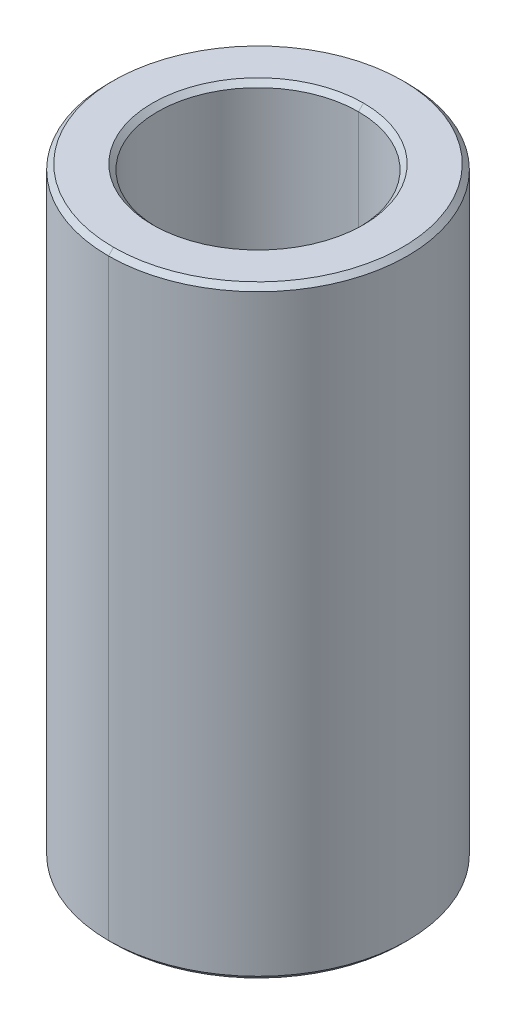
ISO-10303-21;
HEADER;
FILE_DESCRIPTION(('STEP AP214'),'2;1');
FILE_NAME('part.step','',(''),(''),'','','');
FILE_SCHEMA(('AUTOMOTIVE_DESIGN { 1 0 10303 214 1 1 1 1 }'));
ENDSEC;
DATA;
#1=APPLICATION_CONTEXT('core data for automotive mechanical design processes');
#2=APPLICATION_PROTOCOL_DEFINITION('international standard','automotive_design',2000,#1);
#3=PRODUCT_CONTEXT('',#1,'mechanical');
#4=PRODUCT('Part','Part','',(#3));
#5=PRODUCT_RELATED_PRODUCT_CATEGORY('part','',(#4));
#6=PRODUCT_DEFINITION_FORMATION('','',#4);
#7=PRODUCT_DEFINITION_CONTEXT('part definition',#1,'design');
#8=PRODUCT_DEFINITION('design','',#6,#7);
#9=PRODUCT_DEFINITION_SHAPE('','',#8);
#10=(LENGTH_UNIT() NAMED_UNIT(*) SI_UNIT(.MILLI.,.METRE.));
#11=(NAMED_UNIT(*) PLANE_ANGLE_UNIT() SI_UNIT($,.RADIAN.));
#12=(NAMED_UNIT(*) SI_UNIT($,.STERADIAN.) SOLID_ANGLE_UNIT());
#13=UNCERTAINTY_MEASURE_WITH_UNIT(LENGTH_MEASURE(1.E-05),#10,'distance_accuracy_value','');
#14=(GEOMETRIC_REPRESENTATION_CONTEXT(3) GLOBAL_UNCERTAINTY_ASSIGNED_CONTEXT((#13)) GLOBAL_UNIT_ASSIGNED_CONTEXT((#10,
#11,#12)) REPRESENTATION_CONTEXT('',''));
#15=CARTESIAN_POINT('',(0.,0.,0.));
#16=DIRECTION('',(0.,0.,1.));
#17=DIRECTION('',(1.,0.,0.));
#18=AXIS2_PLACEMENT_3D('',#15,#16,#17);
#19=CARTESIAN_POINT('',(0.,5.9,0.));
#20=DIRECTION('',(0.,1.,0.));
#21=DIRECTION('',(0.,0.,1.));
#22=AXIS2_PLACEMENT_3D('',#19,#20,#21);
#23=CONICAL_SURFACE('',#22,2.,0.785398163397457);
#24=DIRECTION('',(0.,0.707106781186542,-0.707106781186554));
#25=VECTOR('',#24,1.);
#26=CARTESIAN_POINT('',(0.,5.9,-2.));
#27=LINE('',#26,#25);
#28=CARTESIAN_POINT('',(0.,5.9,-2.));
#29=VERTEX_POINT('',#28);
#30=CARTESIAN_POINT('',(0.,6.,-2.1));
#31=VERTEX_POINT('',#30);
#32=EDGE_CURVE('E192',#29,#31,#27,.T.);
#33=ORIENTED_EDGE('',*,*,#32,.F.);
#34=CARTESIAN_POINT('',(0.,5.9,0.));
#35=DIRECTION('',(0.,1.,0.));
#36=DIRECTION('',(0.,0.,1.));
#37=AXIS2_PLACEMENT_3D('',#34,#35,#36);
#38=CIRCLE('',#37,2.);
#39=CARTESIAN_POINT('',(0.,5.9,2.));
#40=VERTEX_POINT('',#39);
#41=EDGE_CURVE('E24',#40,#29,#38,.T.);
#42=ORIENTED_EDGE('',*,*,#41,.F.);
#43=DIRECTION('',(0.,0.707106781186542,0.707106781186554));
#44=VECTOR('',#43,1.);
#45=CARTESIAN_POINT('',(0.,5.9,2.));
#46=LINE('',#45,#44);
#47=CARTESIAN_POINT('',(0.,6.,2.1));
#48=VERTEX_POINT('',#47);
#49=EDGE_CURVE('E136',#40,#48,#46,.T.);
#50=ORIENTED_EDGE('',*,*,#49,.T.);
#51=CARTESIAN_POINT('',(0.,6.,0.));
#52=DIRECTION('',(0.,-1.,0.));
#53=DIRECTION('',(0.,0.,1.));
#54=AXIS2_PLACEMENT_3D('',#51,#52,#53);
#55=CIRCLE('',#54,2.1);
#56=EDGE_CURVE('E166',#31,#48,#55,.T.);
#57=ORIENTED_EDGE('',*,*,#56,.F.);
#58=EDGE_LOOP('',(#33,#42,#50,#57));
#59=FACE_BOUND('',#58,.T.);
#60=ADVANCED_FACE('F15',(#59),#23,.F.);
#61=CARTESIAN_POINT('',(0.,-6.,0.));
#62=DIRECTION('',(0.,-1.,0.));
#63=DIRECTION('',(0.,0.,-1.));
#64=AXIS2_PLACEMENT_3D('',#61,#62,#63);
#65=CONICAL_SURFACE('',#64,2.1,0.785398163397448);
#66=DIRECTION('',(0.,-0.707106781186548,0.707106781186548));
#67=VECTOR('',#66,1.);
#68=CARTESIAN_POINT('',(0.,-6.,2.1));
#69=LINE('',#68,#67);
#70=CARTESIAN_POINT('',(0.,-5.9,2.));
#71=VERTEX_POINT('',#70);
#72=CARTESIAN_POINT('',(0.,-6.,2.1));
#73=VERTEX_POINT('',#72);
#74=EDGE_CURVE('E110',#71,#73,#69,.T.);
#75=ORIENTED_EDGE('',*,*,#74,.F.);
#76=CARTESIAN_POINT('',(0.,-5.9,0.));
#77=DIRECTION('',(0.,-1.,0.));
#78=DIRECTION('',(0.,0.,1.));
#79=AXIS2_PLACEMENT_3D('',#76,#77,#78);
#80=CIRCLE('',#79,2.);
#81=CARTESIAN_POINT('',(0.,-5.9,-2.));
#82=VERTEX_POINT('',#81);
#83=EDGE_CURVE('E10',#82,#71,#80,.T.);
#84=ORIENTED_EDGE('',*,*,#83,.F.);
#85=DIRECTION('',(0.,-0.707106781186548,-0.707106781186548));
#86=VECTOR('',#85,1.);
#87=CARTESIAN_POINT('',(0.,-6.,-2.1));
#88=LINE('',#87,#86);
#89=CARTESIAN_POINT('',(0.,-6.,-2.1));
#90=VERTEX_POINT('',#89);
#91=EDGE_CURVE('E107',#82,#90,#88,.T.);
#92=ORIENTED_EDGE('',*,*,#91,.T.);
#93=CARTESIAN_POINT('',(0.,-6.,0.));
#94=DIRECTION('',(0.,1.,0.));
#95=DIRECTION('',(0.,0.,1.));
#96=AXIS2_PLACEMENT_3D('',#93,#94,#95);
#97=CIRCLE('',#96,2.1);
#98=EDGE_CURVE('E165',#73,#90,#97,.T.);
#99=ORIENTED_EDGE('',*,*,#98,.F.);
#100=EDGE_LOOP('',(#75,#84,#92,#99));
#101=FACE_BOUND('',#100,.T.);
#102=ADVANCED_FACE('F105',(#101),#65,.F.);
#103=CARTESIAN_POINT('',(0.,6.,0.));
#104=DIRECTION('',(0.,-1.,0.));
#105=DIRECTION('',(0.,0.,-1.));
#106=AXIS2_PLACEMENT_3D('',#103,#104,#105);
#107=CONICAL_SURFACE('',#106,2.875,0.785398163397443);
#108=DIRECTION('',(0.,-0.707106781186551,0.707106781186545));
#109=VECTOR('',#108,1.);
#110=CARTESIAN_POINT('',(0.,6.,2.875));
#111=LINE('',#110,#109);
#112=CARTESIAN_POINT('',(0.,6.,2.875));
#113=VERTEX_POINT('',#112);
#114=CARTESIAN_POINT('',(0.,5.9,2.975));
#115=VERTEX_POINT('',#114);
#116=EDGE_CURVE('E152',#113,#115,#111,.T.);
#117=ORIENTED_EDGE('',*,*,#116,.F.);
#118=CARTESIAN_POINT('',(0.,6.,0.));
#119=DIRECTION('',(0.,1.,0.));
#120=DIRECTION('',(0.,0.,1.));
#121=AXIS2_PLACEMENT_3D('',#118,#119,#120);
#122=CIRCLE('',#121,2.875);
#123=CARTESIAN_POINT('',(0.,6.,-2.875));
#124=VERTEX_POINT('',#123);
#125=EDGE_CURVE('E170',#124,#113,#122,.T.);
#126=ORIENTED_EDGE('',*,*,#125,.F.);
#127=DIRECTION('',(0.,-0.707106781186551,-0.707106781186545));
#128=VECTOR('',#127,1.);
#129=CARTESIAN_POINT('',(0.,6.,-2.875));
#130=LINE('',#129,#128);
#131=CARTESIAN_POINT('',(0.,5.9,-2.975));
#132=VERTEX_POINT('',#131);
#133=EDGE_CURVE('E179',#124,#132,#130,.T.);
#134=ORIENTED_EDGE('',*,*,#133,.T.);
#135=CARTESIAN_POINT('',(0.,5.9,0.));
#136=DIRECTION('',(0.,-1.,0.));
#137=DIRECTION('',(0.,0.,1.));
#138=AXIS2_PLACEMENT_3D('',#135,#136,#137);
#139=CIRCLE('',#138,2.975);
#140=EDGE_CURVE('E18',#115,#132,#139,.T.);
#141=ORIENTED_EDGE('',*,*,#140,.F.);
#142=EDGE_LOOP('',(#117,#126,#134,#141));
#143=FACE_BOUND('',#142,.T.);
#144=ADVANCED_FACE('F266',(#143),#107,.T.);
#145=CARTESIAN_POINT('',(0.,-5.9,0.));
#146=DIRECTION('',(0.,1.,0.));
#147=DIRECTION('',(0.,0.,1.));
#148=AXIS2_PLACEMENT_3D('',#145,#146,#147);
#149=CONICAL_SURFACE('',#148,2.975,0.785398163397443);
#150=DIRECTION('',(0.,0.707106781186551,-0.707106781186545));
#151=VECTOR('',#150,1.);
#152=CARTESIAN_POINT('',(0.,-5.9,-2.975));
#153=LINE('',#152,#151);
#154=CARTESIAN_POINT('',(0.,-6.,-2.875));
#155=VERTEX_POINT('',#154);
#156=CARTESIAN_POINT('',(0.,-5.9,-2.975));
#157=VERTEX_POINT('',#156);
#158=EDGE_CURVE('E162',#155,#157,#153,.T.);
#159=ORIENTED_EDGE('',*,*,#158,.F.);
#160=CARTESIAN_POINT('',(0.,-6.,0.));
#161=DIRECTION('',(0.,-1.,0.));
#162=DIRECTION('',(0.,0.,1.));
#163=AXIS2_PLACEMENT_3D('',#160,#161,#162);
#164=CIRCLE('',#163,2.875);
#165=CARTESIAN_POINT('',(0.,-6.,2.875));
#166=VERTEX_POINT('',#165);
#167=EDGE_CURVE('E163',#166,#155,#164,.T.);
#168=ORIENTED_EDGE('',*,*,#167,.F.);
#169=DIRECTION('',(0.,0.707106781186551,0.707106781186545));
#170=VECTOR('',#169,1.);
#171=CARTESIAN_POINT('',(0.,-5.9,2.975));
#172=LINE('',#171,#170);
#173=CARTESIAN_POINT('',(0.,-5.9,2.975));
#174=VERTEX_POINT('',#173);
#175=EDGE_CURVE('E161',#166,#174,#172,.T.);
#176=ORIENTED_EDGE('',*,*,#175,.T.);
#177=CARTESIAN_POINT('',(0.,-5.9,0.));
#178=DIRECTION('',(0.,1.,0.));
#179=DIRECTION('',(0.,0.,1.));
#180=AXIS2_PLACEMENT_3D('',#177,#178,#179);
#181=CIRCLE('',#180,2.975);
#182=EDGE_CURVE('E38',#157,#174,#181,.T.);
#183=ORIENTED_EDGE('',*,*,#182,.F.);
#184=EDGE_LOOP('',(#159,#168,#176,#183));
#185=FACE_BOUND('',#184,.T.);
#186=ADVANCED_FACE('F261',(#185),#149,.T.);
#187=CARTESIAN_POINT('',(0.,6.,0.));
#188=DIRECTION('',(0.,-1.,0.));
#189=DIRECTION('',(0.,0.,-1.));
#190=AXIS2_PLACEMENT_3D('',#187,#188,#189);
#191=CYLINDRICAL_SURFACE('',#190,2.);
#192=DIRECTION('',(0.,-1.,0.));
#193=VECTOR('',#192,1.);
#194=CARTESIAN_POINT('',(0.,6.,2.));
#195=LINE('',#194,#193);
#196=EDGE_CURVE('E125',#40,#71,#195,.T.);
#197=ORIENTED_EDGE('',*,*,#196,.F.);
#198=ORIENTED_EDGE('',*,*,#41,.T.);
#199=DIRECTION('',(0.,-1.,0.));
#200=VECTOR('',#199,1.);
#201=CARTESIAN_POINT('',(0.,6.,-2.));
#202=LINE('',#201,#200);
#203=EDGE_CURVE('E117',#29,#82,#202,.T.);
#204=ORIENTED_EDGE('',*,*,#203,.T.);
#205=ORIENTED_EDGE('',*,*,#83,.T.);
#206=EDGE_LOOP('',(#197,#198,#204,#205));
#207=FACE_BOUND('',#206,.T.);
#208=ADVANCED_FACE('F118',(#207),#191,.F.);
#209=CARTESIAN_POINT('',(0.,6.,0.));
#210=DIRECTION('',(0.,-1.,0.));
#211=DIRECTION('',(0.,0.,-1.));
#212=AXIS2_PLACEMENT_3D('',#209,#210,#211);
#213=CYLINDRICAL_SURFACE('',#212,2.975);
#214=DIRECTION('',(0.,-1.,0.));
#215=VECTOR('',#214,1.);
#216=CARTESIAN_POINT('',(0.,6.,2.975));
#217=LINE('',#216,#215);
#218=EDGE_CURVE('E124',#115,#174,#217,.T.);
#219=ORIENTED_EDGE('',*,*,#218,.F.);
#220=ORIENTED_EDGE('',*,*,#140,.T.);
#221=DIRECTION('',(0.,-1.,0.));
#222=VECTOR('',#221,1.);
#223=CARTESIAN_POINT('',(0.,6.,-2.975));
#224=LINE('',#223,#222);
#225=EDGE_CURVE('E168',#132,#157,#224,.T.);
#226=ORIENTED_EDGE('',*,*,#225,.T.);
#227=ORIENTED_EDGE('',*,*,#182,.T.);
#228=EDGE_LOOP('',(#219,#220,#226,#227));
#229=FACE_BOUND('',#228,.T.);
#230=ADVANCED_FACE('F247',(#229),#213,.T.);
#231=CARTESIAN_POINT('',(0.,-6.,0.));
#232=DIRECTION('',(0.,1.,0.));
#233=DIRECTION('',(1.,0.,0.));
#234=AXIS2_PLACEMENT_3D('',#231,#232,#233);
#235=PLANE('',#234);
#236=CARTESIAN_POINT('',(0.,-6.,0.));
#237=DIRECTION('',(0.,1.,0.));
#238=DIRECTION('',(0.,0.,1.));
#239=AXIS2_PLACEMENT_3D('',#236,#237,#238);
#240=CIRCLE('',#239,2.1);
#241=EDGE_CURVE('E131',#90,#73,#240,.T.);
#242=ORIENTED_EDGE('',*,*,#241,.T.);
#243=ORIENTED_EDGE('',*,*,#98,.T.);
#244=EDGE_LOOP('',(#242,#243));
#245=FACE_BOUND('',#244,.T.);
#246=ORIENTED_EDGE('',*,*,#167,.T.);
#247=CARTESIAN_POINT('',(0.,-6.,0.));
#248=DIRECTION('',(0.,-1.,0.));
#249=DIRECTION('',(0.,0.,1.));
#250=AXIS2_PLACEMENT_3D('',#247,#248,#249);
#251=CIRCLE('',#250,2.875);
#252=EDGE_CURVE('E200',#155,#166,#251,.T.);
#253=ORIENTED_EDGE('',*,*,#252,.T.);
#254=EDGE_LOOP('',(#246,#253));
#255=FACE_BOUND('',#254,.T.);
#256=ADVANCED_FACE('F252',(#245,#255),#235,.F.);
#257=CARTESIAN_POINT('',(0.,6.,0.));
#258=DIRECTION('',(0.,1.,0.));
#259=DIRECTION('',(1.,0.,0.));
#260=AXIS2_PLACEMENT_3D('',#257,#258,#259);
#261=PLANE('',#260);
#262=CARTESIAN_POINT('',(0.,6.,0.));
#263=DIRECTION('',(0.,-1.,0.));
#264=DIRECTION('',(0.,0.,1.));
#265=AXIS2_PLACEMENT_3D('',#262,#263,#264);
#266=CIRCLE('',#265,2.1);
#267=EDGE_CURVE('E146',#48,#31,#266,.T.);
#268=ORIENTED_EDGE('',*,*,#267,.T.);
#269=ORIENTED_EDGE('',*,*,#56,.T.);
#270=EDGE_LOOP('',(#268,#269));
#271=FACE_BOUND('',#270,.T.);
#272=ORIENTED_EDGE('',*,*,#125,.T.);
#273=CARTESIAN_POINT('',(0.,6.,0.));
#274=DIRECTION('',(0.,1.,0.));
#275=DIRECTION('',(0.,0.,1.));
#276=AXIS2_PLACEMENT_3D('',#273,#274,#275);
#277=CIRCLE('',#276,2.875);
#278=EDGE_CURVE('E133',#113,#124,#277,.T.);
#279=ORIENTED_EDGE('',*,*,#278,.T.);
#280=EDGE_LOOP('',(#272,#279));
#281=FACE_BOUND('',#280,.T.);
#282=ADVANCED_FACE('F213',(#271,#281),#261,.T.);
#283=CARTESIAN_POINT('',(0.,6.,0.));
#284=DIRECTION('',(0.,-1.,0.));
#285=DIRECTION('',(0.,0.,-1.));
#286=AXIS2_PLACEMENT_3D('',#283,#284,#285);
#287=CYLINDRICAL_SURFACE('',#286,2.975);
#288=CARTESIAN_POINT('',(0.,5.9,0.));
#289=DIRECTION('',(0.,-1.,0.));
#290=DIRECTION('',(0.,0.,1.));
#291=AXIS2_PLACEMENT_3D('',#288,#289,#290);
#292=CIRCLE('',#291,2.975);
#293=EDGE_CURVE('E156',#132,#115,#292,.T.);
#294=ORIENTED_EDGE('',*,*,#293,.T.);
#295=ORIENTED_EDGE('',*,*,#218,.T.);
#296=CARTESIAN_POINT('',(0.,-5.9,0.));
#297=DIRECTION('',(0.,1.,0.));
#298=DIRECTION('',(0.,0.,1.));
#299=AXIS2_PLACEMENT_3D('',#296,#297,#298);
#300=CIRCLE('',#299,2.975);
#301=EDGE_CURVE('E157',#174,#157,#300,.T.);
#302=ORIENTED_EDGE('',*,*,#301,.T.);
#303=ORIENTED_EDGE('',*,*,#225,.F.);
#304=EDGE_LOOP('',(#294,#295,#302,#303));
#305=FACE_BOUND('',#304,.T.);
#306=ADVANCED_FACE('F298',(#305),#287,.T.);
#307=CARTESIAN_POINT('',(0.,6.,0.));
#308=DIRECTION('',(0.,-1.,0.));
#309=DIRECTION('',(0.,0.,-1.));
#310=AXIS2_PLACEMENT_3D('',#307,#308,#309);
#311=CYLINDRICAL_SURFACE('',#310,2.);
#312=CARTESIAN_POINT('',(0.,5.9,0.));
#313=DIRECTION('',(0.,1.,0.));
#314=DIRECTION('',(0.,0.,1.));
#315=AXIS2_PLACEMENT_3D('',#312,#313,#314);
#316=CIRCLE('',#315,2.);
#317=EDGE_CURVE('E189',#29,#40,#316,.T.);
#318=ORIENTED_EDGE('',*,*,#317,.T.);
#319=ORIENTED_EDGE('',*,*,#196,.T.);
#320=CARTESIAN_POINT('',(0.,-5.9,0.));
#321=DIRECTION('',(0.,-1.,0.));
#322=DIRECTION('',(0.,0.,1.));
#323=AXIS2_PLACEMENT_3D('',#320,#321,#322);
#324=CIRCLE('',#323,2.);
#325=EDGE_CURVE('E129',#71,#82,#324,.T.);
#326=ORIENTED_EDGE('',*,*,#325,.T.);
#327=ORIENTED_EDGE('',*,*,#203,.F.);
#328=EDGE_LOOP('',(#318,#319,#326,#327));
#329=FACE_BOUND('',#328,.T.);
#330=ADVANCED_FACE('F134',(#329),#311,.F.);
#331=CARTESIAN_POINT('',(0.,-5.9,0.));
#332=DIRECTION('',(0.,1.,0.));
#333=DIRECTION('',(0.,0.,1.));
#334=AXIS2_PLACEMENT_3D('',#331,#332,#333);
#335=CONICAL_SURFACE('',#334,2.975,0.785398163397443);
#336=ORIENTED_EDGE('',*,*,#252,.F.);
#337=ORIENTED_EDGE('',*,*,#158,.T.);
#338=ORIENTED_EDGE('',*,*,#301,.F.);
#339=ORIENTED_EDGE('',*,*,#175,.F.);
#340=EDGE_LOOP('',(#336,#337,#338,#339));
#341=FACE_BOUND('',#340,.T.);
#342=ADVANCED_FACE('F279',(#341),#335,.T.);
#343=CARTESIAN_POINT('',(0.,6.,0.));
#344=DIRECTION('',(0.,-1.,0.));
#345=DIRECTION('',(0.,0.,-1.));
#346=AXIS2_PLACEMENT_3D('',#343,#344,#345);
#347=CONICAL_SURFACE('',#346,2.875,0.785398163397443);
#348=ORIENTED_EDGE('',*,*,#278,.F.);
#349=ORIENTED_EDGE('',*,*,#116,.T.);
#350=ORIENTED_EDGE('',*,*,#293,.F.);
#351=ORIENTED_EDGE('',*,*,#133,.F.);
#352=EDGE_LOOP('',(#348,#349,#350,#351));
#353=FACE_BOUND('',#352,.T.);
#354=ADVANCED_FACE('F274',(#353),#347,.T.);
#355=CARTESIAN_POINT('',(0.,-6.,0.));
#356=DIRECTION('',(0.,-1.,0.));
#357=DIRECTION('',(0.,0.,-1.));
#358=AXIS2_PLACEMENT_3D('',#355,#356,#357);
#359=CONICAL_SURFACE('',#358,2.1,0.785398163397448);
#360=ORIENTED_EDGE('',*,*,#325,.F.);
#361=ORIENTED_EDGE('',*,*,#74,.T.);
#362=ORIENTED_EDGE('',*,*,#241,.F.);
#363=ORIENTED_EDGE('',*,*,#91,.F.);
#364=EDGE_LOOP('',(#360,#361,#362,#363));
#365=FACE_BOUND('',#364,.T.);
#366=ADVANCED_FACE('F128',(#365),#359,.F.);
#367=CARTESIAN_POINT('',(0.,5.9,0.));
#368=DIRECTION('',(0.,1.,0.));
#369=DIRECTION('',(0.,0.,1.));
#370=AXIS2_PLACEMENT_3D('',#367,#368,#369);
#371=CONICAL_SURFACE('',#370,2.,0.785398163397457);
#372=ORIENTED_EDGE('',*,*,#317,.F.);
#373=ORIENTED_EDGE('',*,*,#32,.T.);
#374=ORIENTED_EDGE('',*,*,#267,.F.);
#375=ORIENTED_EDGE('',*,*,#49,.F.);
#376=EDGE_LOOP('',(#372,#373,#374,#375));
#377=FACE_BOUND('',#376,.T.);
#378=ADVANCED_FACE('F216',(#377),#371,.F.);
#379=CLOSED_SHELL('',(#60,#102,#144,#186,#208,#230,#256,#282,#306,#330,#342,#354,#366,#378));
#380=MANIFOLD_SOLID_BREP('B1',#379);
#381=ADVANCED_BREP_SHAPE_REPRESENTATION('',(#18,#380),#14);
#382=SHAPE_DEFINITION_REPRESENTATION(#9,#381);
ENDSEC;
END-ISO-10303-21;
